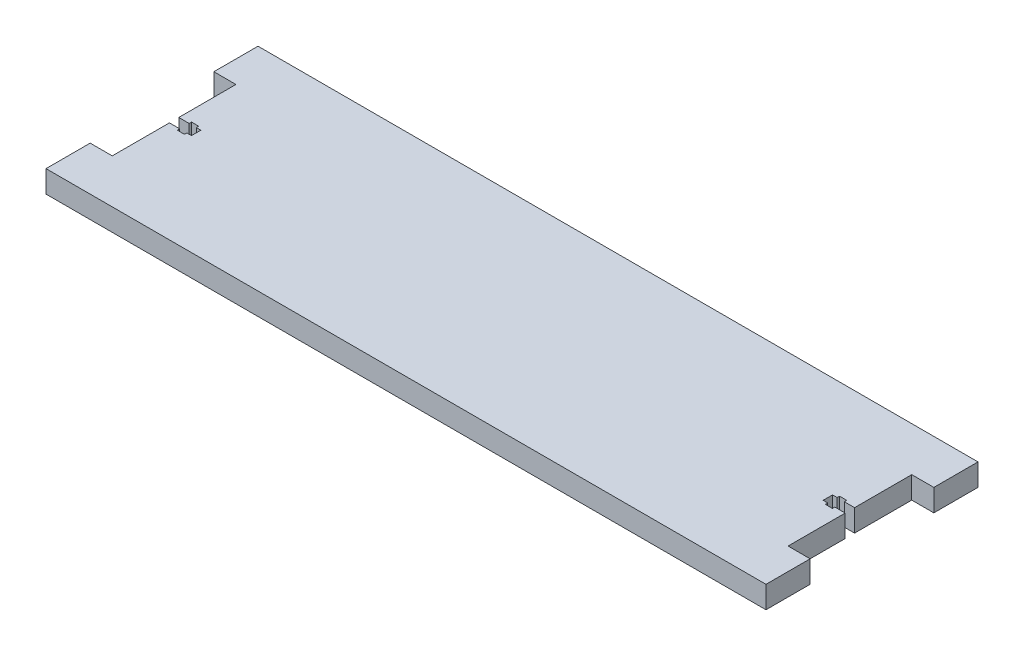
ISO-10303-21;
HEADER;
FILE_DESCRIPTION(('STEP AP214'),'2;1');
FILE_NAME('part.step','',(''),(''),'','','');
FILE_SCHEMA(('AUTOMOTIVE_DESIGN { 1 0 10303 214 1 1 1 1 }'));
ENDSEC;
DATA;
#1=APPLICATION_CONTEXT('core data for automotive mechanical design processes');
#2=APPLICATION_PROTOCOL_DEFINITION('international standard','automotive_design',2000,#1);
#3=PRODUCT_CONTEXT('',#1,'mechanical');
#4=PRODUCT('Part','Part','',(#3));
#5=PRODUCT_RELATED_PRODUCT_CATEGORY('part','',(#4));
#6=PRODUCT_DEFINITION_FORMATION('','',#4);
#7=PRODUCT_DEFINITION_CONTEXT('part definition',#1,'design');
#8=PRODUCT_DEFINITION('design','',#6,#7);
#9=PRODUCT_DEFINITION_SHAPE('','',#8);
#10=(LENGTH_UNIT() NAMED_UNIT(*) SI_UNIT(.MILLI.,.METRE.));
#11=(NAMED_UNIT(*) PLANE_ANGLE_UNIT() SI_UNIT($,.RADIAN.));
#12=(NAMED_UNIT(*) SI_UNIT($,.STERADIAN.) SOLID_ANGLE_UNIT());
#13=UNCERTAINTY_MEASURE_WITH_UNIT(LENGTH_MEASURE(1.E-05),#10,'distance_accuracy_value','');
#14=(GEOMETRIC_REPRESENTATION_CONTEXT(3) GLOBAL_UNCERTAINTY_ASSIGNED_CONTEXT((#13)) GLOBAL_UNIT_ASSIGNED_CONTEXT((#10,
#11,#12)) REPRESENTATION_CONTEXT('',''));
#15=CARTESIAN_POINT('',(0.,0.,0.));
#16=DIRECTION('',(0.,0.,1.));
#17=DIRECTION('',(1.,0.,0.));
#18=AXIS2_PLACEMENT_3D('',#15,#16,#17);
#19=CARTESIAN_POINT('',(0.,12.7,0.));
#20=DIRECTION('',(0.,-1.,0.));
#21=DIRECTION('',(0.,0.,-1.));
#22=AXIS2_PLACEMENT_3D('',#19,#20,#21);
#23=PLANE('',#22);
#24=DIRECTION('',(0.,0.,1.));
#25=VECTOR('',#24,1.);
#26=CARTESIAN_POINT('',(382.67,12.7,-56.885));
#27=LINE('',#26,#25);
#28=CARTESIAN_POINT('',(382.67,12.7,-58.26));
#29=VERTEX_POINT('',#28);
#30=CARTESIAN_POINT('',(382.67,12.7,-56.885));
#31=VERTEX_POINT('',#30);
#32=EDGE_CURVE('E302',#29,#31,#27,.T.);
#33=ORIENTED_EDGE('',*,*,#32,.T.);
#34=DIRECTION('',(-1.,0.,0.));
#35=VECTOR('',#34,1.);
#36=CARTESIAN_POINT('',(378.57,12.7,-56.885));
#37=LINE('',#36,#35);
#38=CARTESIAN_POINT('',(378.57,12.7,-56.885));
#39=VERTEX_POINT('',#38);
#40=EDGE_CURVE('E296',#31,#39,#37,.T.);
#41=ORIENTED_EDGE('',*,*,#40,.T.);
#42=DIRECTION('',(0.,0.,-1.));
#43=VECTOR('',#42,1.);
#44=CARTESIAN_POINT('',(378.57,12.7,-56.885));
#45=LINE('',#44,#43);
#46=CARTESIAN_POINT('',(378.57,12.7,-58.26));
#47=VERTEX_POINT('',#46);
#48=EDGE_CURVE('E282',#39,#47,#45,.T.);
#49=ORIENTED_EDGE('',*,*,#48,.T.);
#50=DIRECTION('',(1.,0.,0.));
#51=VECTOR('',#50,1.);
#52=CARTESIAN_POINT('',(375.92,12.7,-58.26));
#53=LINE('',#52,#51);
#54=CARTESIAN_POINT('',(375.92,12.7,-58.26));
#55=VERTEX_POINT('',#54);
#56=EDGE_CURVE('E326',#55,#47,#53,.T.);
#57=ORIENTED_EDGE('',*,*,#56,.F.);
#58=DIRECTION('',(0.,0.,-1.));
#59=VECTOR('',#58,1.);
#60=CARTESIAN_POINT('',(375.92,12.7,-63.66));
#61=LINE('',#60,#59);
#62=CARTESIAN_POINT('',(375.92,12.7,-63.66));
#63=VERTEX_POINT('',#62);
#64=EDGE_CURVE('E318',#55,#63,#61,.T.);
#65=ORIENTED_EDGE('',*,*,#64,.T.);
#66=DIRECTION('',(1.,0.,0.));
#67=VECTOR('',#66,1.);
#68=CARTESIAN_POINT('',(375.92,12.7,-63.66));
#69=LINE('',#68,#67);
#70=CARTESIAN_POINT('',(378.57,12.7,-63.66));
#71=VERTEX_POINT('',#70);
#72=EDGE_CURVE('E331',#63,#71,#69,.T.);
#73=ORIENTED_EDGE('',*,*,#72,.T.);
#74=CARTESIAN_POINT('',(378.57,12.7,-65.035));
#75=VERTEX_POINT('',#74);
#76=EDGE_CURVE('E56',#71,#75,#45,.T.);
#77=ORIENTED_EDGE('',*,*,#76,.T.);
#78=DIRECTION('',(1.,0.,0.));
#79=VECTOR('',#78,1.);
#80=CARTESIAN_POINT('',(378.57,12.7,-65.035));
#81=LINE('',#80,#79);
#82=CARTESIAN_POINT('',(382.67,12.7,-65.035));
#83=VERTEX_POINT('',#82);
#84=EDGE_CURVE('E281',#75,#83,#81,.T.);
#85=ORIENTED_EDGE('',*,*,#84,.T.);
#86=CARTESIAN_POINT('',(382.67,12.7,-63.66));
#87=VERTEX_POINT('',#86);
#88=EDGE_CURVE('E297',#83,#87,#27,.T.);
#89=ORIENTED_EDGE('',*,*,#88,.T.);
#90=CARTESIAN_POINT('',(388.62,12.7,-63.66));
#91=VERTEX_POINT('',#90);
#92=EDGE_CURVE('E334',#87,#91,#69,.T.);
#93=ORIENTED_EDGE('',*,*,#92,.T.);
#94=DIRECTION('',(0.,0.,-1.));
#95=VECTOR('',#94,1.);
#96=CARTESIAN_POINT('',(388.62,12.7,0.));
#97=LINE('',#96,#95);
#98=CARTESIAN_POINT('',(388.62,12.7,-96.5199999999999));
#99=VERTEX_POINT('',#98);
#100=EDGE_CURVE('E497',#91,#99,#97,.T.);
#101=ORIENTED_EDGE('',*,*,#100,.T.);
#102=DIRECTION('',(1.,0.,0.));
#103=VECTOR('',#102,1.);
#104=CARTESIAN_POINT('',(388.62,12.7,-96.5199999999999));
#105=LINE('',#104,#103);
#106=CARTESIAN_POINT('',(401.32,12.7,-96.5199999999999));
#107=VERTEX_POINT('',#106);
#108=EDGE_CURVE('E403',#99,#107,#105,.T.);
#109=ORIENTED_EDGE('',*,*,#108,.T.);
#110=DIRECTION('',(0.,0.,-1.));
#111=VECTOR('',#110,1.);
#112=CARTESIAN_POINT('',(401.32,12.7,-121.92));
#113=LINE('',#112,#111);
#114=CARTESIAN_POINT('',(401.32,12.7,-121.92));
#115=VERTEX_POINT('',#114);
#116=EDGE_CURVE('E416',#107,#115,#113,.T.);
#117=ORIENTED_EDGE('',*,*,#116,.T.);
#118=DIRECTION('',(-1.,0.,0.));
#119=VECTOR('',#118,1.);
#120=CARTESIAN_POINT('',(0.,12.7,-121.92));
#121=LINE('',#120,#119);
#122=CARTESIAN_POINT('',(-12.7,12.7,-121.92));
#123=VERTEX_POINT('',#122);
#124=EDGE_CURVE('E476',#115,#123,#121,.T.);
#125=ORIENTED_EDGE('',*,*,#124,.T.);
#126=DIRECTION('',(0.,0.,1.));
#127=VECTOR('',#126,1.);
#128=CARTESIAN_POINT('',(-12.7,12.7,-121.92));
#129=LINE('',#128,#127);
#130=CARTESIAN_POINT('',(-12.7,12.7,-96.5199999999999));
#131=VERTEX_POINT('',#130);
#132=EDGE_CURVE('E546',#123,#131,#129,.T.);
#133=ORIENTED_EDGE('',*,*,#132,.T.);
#134=DIRECTION('',(1.,0.,0.));
#135=VECTOR('',#134,1.);
#136=CARTESIAN_POINT('',(0.,12.7,-96.5199999999999));
#137=LINE('',#136,#135);
#138=CARTESIAN_POINT('',(0.,12.7,-96.5199999999999));
#139=VERTEX_POINT('',#138);
#140=EDGE_CURVE('E544',#131,#139,#137,.T.);
#141=ORIENTED_EDGE('',*,*,#140,.T.);
#142=DIRECTION('',(0.,0.,1.));
#143=VECTOR('',#142,1.);
#144=CARTESIAN_POINT('',(0.,12.7,0.));
#145=LINE('',#144,#143);
#146=CARTESIAN_POINT('',(0.,12.7,-63.66));
#147=VERTEX_POINT('',#146);
#148=EDGE_CURVE('E485',#139,#147,#145,.T.);
#149=ORIENTED_EDGE('',*,*,#148,.T.);
#150=DIRECTION('',(-1.,0.,0.));
#151=VECTOR('',#150,1.);
#152=CARTESIAN_POINT('',(12.7,12.7,-63.66));
#153=LINE('',#152,#151);
#154=CARTESIAN_POINT('',(5.95,12.7,-63.66));
#155=VERTEX_POINT('',#154);
#156=EDGE_CURVE('E412',#155,#147,#153,.T.);
#157=ORIENTED_EDGE('',*,*,#156,.F.);
#158=DIRECTION('',(0.,0.,1.));
#159=VECTOR('',#158,1.);
#160=CARTESIAN_POINT('',(5.95,12.7,-56.8849999999999));
#161=LINE('',#160,#159);
#162=CARTESIAN_POINT('',(5.95,12.7,-65.035));
#163=VERTEX_POINT('',#162);
#164=EDGE_CURVE('E351',#163,#155,#161,.T.);
#165=ORIENTED_EDGE('',*,*,#164,.F.);
#166=DIRECTION('',(-1.,0.,0.));
#167=VECTOR('',#166,1.);
#168=CARTESIAN_POINT('',(10.05,12.7,-65.035));
#169=LINE('',#168,#167);
#170=CARTESIAN_POINT('',(10.05,12.7,-65.035));
#171=VERTEX_POINT('',#170);
#172=EDGE_CURVE('E341',#171,#163,#169,.T.);
#173=ORIENTED_EDGE('',*,*,#172,.F.);
#174=DIRECTION('',(0.,0.,-1.));
#175=VECTOR('',#174,1.);
#176=CARTESIAN_POINT('',(10.05,12.7,-56.8849999999999));
#177=LINE('',#176,#175);
#178=CARTESIAN_POINT('',(10.05,12.7,-63.66));
#179=VERTEX_POINT('',#178);
#180=EDGE_CURVE('E347',#179,#171,#177,.T.);
#181=ORIENTED_EDGE('',*,*,#180,.F.);
#182=CARTESIAN_POINT('',(12.7,12.7,-63.66));
#183=VERTEX_POINT('',#182);
#184=EDGE_CURVE('E409',#183,#179,#153,.T.);
#185=ORIENTED_EDGE('',*,*,#184,.F.);
#186=DIRECTION('',(0.,0.,-1.));
#187=VECTOR('',#186,1.);
#188=CARTESIAN_POINT('',(12.7,12.7,-63.66));
#189=LINE('',#188,#187);
#190=CARTESIAN_POINT('',(12.7,12.7,-58.2599999999999));
#191=VERTEX_POINT('',#190);
#192=EDGE_CURVE('E386',#191,#183,#189,.T.);
#193=ORIENTED_EDGE('',*,*,#192,.F.);
#194=DIRECTION('',(-1.,0.,0.));
#195=VECTOR('',#194,1.);
#196=CARTESIAN_POINT('',(12.7,12.7,-58.2599999999999));
#197=LINE('',#196,#195);
#198=CARTESIAN_POINT('',(10.05,12.7,-58.2599999999999));
#199=VERTEX_POINT('',#198);
#200=EDGE_CURVE('E413',#191,#199,#197,.T.);
#201=ORIENTED_EDGE('',*,*,#200,.T.);
#202=CARTESIAN_POINT('',(10.05,12.7,-56.8849999999999));
#203=VERTEX_POINT('',#202);
#204=EDGE_CURVE('E345',#203,#199,#177,.T.);
#205=ORIENTED_EDGE('',*,*,#204,.F.);
#206=DIRECTION('',(1.,0.,0.));
#207=VECTOR('',#206,1.);
#208=CARTESIAN_POINT('',(10.05,12.7,-56.8849999999999));
#209=LINE('',#208,#207);
#210=CARTESIAN_POINT('',(5.95,12.7,-56.8849999999999));
#211=VERTEX_POINT('',#210);
#212=EDGE_CURVE('E348',#211,#203,#209,.T.);
#213=ORIENTED_EDGE('',*,*,#212,.F.);
#214=CARTESIAN_POINT('',(5.95,12.7,-58.2599999999999));
#215=VERTEX_POINT('',#214);
#216=EDGE_CURVE('E329',#215,#211,#161,.T.);
#217=ORIENTED_EDGE('',*,*,#216,.F.);
#218=CARTESIAN_POINT('',(0.,12.7,-58.2599999999999));
#219=VERTEX_POINT('',#218);
#220=EDGE_CURVE('E395',#215,#219,#197,.T.);
#221=ORIENTED_EDGE('',*,*,#220,.T.);
#222=CARTESIAN_POINT('',(0.,12.7,-25.4));
#223=VERTEX_POINT('',#222);
#224=EDGE_CURVE('E470',#219,#223,#145,.T.);
#225=ORIENTED_EDGE('',*,*,#224,.T.);
#226=DIRECTION('',(-1.,0.,0.));
#227=VECTOR('',#226,1.);
#228=CARTESIAN_POINT('',(0.,12.7,-25.4));
#229=LINE('',#228,#227);
#230=CARTESIAN_POINT('',(-12.7,12.7,-25.4));
#231=VERTEX_POINT('',#230);
#232=EDGE_CURVE('E452',#223,#231,#229,.T.);
#233=ORIENTED_EDGE('',*,*,#232,.T.);
#234=DIRECTION('',(0.,0.,1.));
#235=VECTOR('',#234,1.);
#236=CARTESIAN_POINT('',(-12.7,12.7,0.));
#237=LINE('',#236,#235);
#238=CARTESIAN_POINT('',(-12.7,12.7,0.));
#239=VERTEX_POINT('',#238);
#240=EDGE_CURVE('E621',#231,#239,#237,.T.);
#241=ORIENTED_EDGE('',*,*,#240,.T.);
#242=DIRECTION('',(1.,0.,0.));
#243=VECTOR('',#242,1.);
#244=CARTESIAN_POINT('',(0.,12.7,0.));
#245=LINE('',#244,#243);
#246=CARTESIAN_POINT('',(401.32,12.7,0.));
#247=VERTEX_POINT('',#246);
#248=EDGE_CURVE('E488',#239,#247,#245,.T.);
#249=ORIENTED_EDGE('',*,*,#248,.T.);
#250=DIRECTION('',(0.,0.,-1.));
#251=VECTOR('',#250,1.);
#252=CARTESIAN_POINT('',(401.32,12.7,0.));
#253=LINE('',#252,#251);
#254=CARTESIAN_POINT('',(401.32,12.7,-25.4));
#255=VERTEX_POINT('',#254);
#256=EDGE_CURVE('E432',#247,#255,#253,.T.);
#257=ORIENTED_EDGE('',*,*,#256,.T.);
#258=DIRECTION('',(-1.,0.,0.));
#259=VECTOR('',#258,1.);
#260=CARTESIAN_POINT('',(388.62,12.7,-25.4));
#261=LINE('',#260,#259);
#262=CARTESIAN_POINT('',(388.62,12.7,-25.4));
#263=VERTEX_POINT('',#262);
#264=EDGE_CURVE('E438',#255,#263,#261,.T.);
#265=ORIENTED_EDGE('',*,*,#264,.T.);
#266=CARTESIAN_POINT('',(388.62,12.7,-58.26));
#267=VERTEX_POINT('',#266);
#268=EDGE_CURVE('E454',#263,#267,#97,.T.);
#269=ORIENTED_EDGE('',*,*,#268,.T.);
#270=EDGE_CURVE('E330',#29,#267,#53,.T.);
#271=ORIENTED_EDGE('',*,*,#270,.F.);
#272=EDGE_LOOP('',(#33,#41,#49,#57,#65,#73,#77,#85,#89,#93,#101,#109,#117,#125,#133,#141,#149,
#157,#165,#173,#181,#185,#193,#201,#205,#213,#217,#221,#225,#233,#241,#249,#257,#265,#269,#271));
#273=FACE_BOUND('',#272,.T.);
#274=ADVANCED_FACE('F33',(#273),#23,.F.);
#275=CARTESIAN_POINT('',(0.,0.,0.));
#276=DIRECTION('',(0.,-1.,0.));
#277=DIRECTION('',(0.,0.,-1.));
#278=AXIS2_PLACEMENT_3D('',#275,#276,#277);
#279=PLANE('',#278);
#280=DIRECTION('',(-1.,0.,0.));
#281=VECTOR('',#280,1.);
#282=CARTESIAN_POINT('',(378.57,0.,-56.885));
#283=LINE('',#282,#281);
#284=CARTESIAN_POINT('',(382.67,0.,-56.885));
#285=VERTEX_POINT('',#284);
#286=CARTESIAN_POINT('',(378.57,0.,-56.885));
#287=VERTEX_POINT('',#286);
#288=EDGE_CURVE('E273',#285,#287,#283,.T.);
#289=ORIENTED_EDGE('',*,*,#288,.F.);
#290=DIRECTION('',(0.,0.,1.));
#291=VECTOR('',#290,1.);
#292=CARTESIAN_POINT('',(382.67,0.,-56.885));
#293=LINE('',#292,#291);
#294=CARTESIAN_POINT('',(382.67,0.,-58.26));
#295=VERTEX_POINT('',#294);
#296=EDGE_CURVE('E288',#295,#285,#293,.T.);
#297=ORIENTED_EDGE('',*,*,#296,.F.);
#298=DIRECTION('',(1.,0.,0.));
#299=VECTOR('',#298,1.);
#300=CARTESIAN_POINT('',(375.92,0.,-58.26));
#301=LINE('',#300,#299);
#302=CARTESIAN_POINT('',(388.62,0.,-58.26));
#303=VERTEX_POINT('',#302);
#304=EDGE_CURVE('E321',#295,#303,#301,.T.);
#305=ORIENTED_EDGE('',*,*,#304,.T.);
#306=DIRECTION('',(0.,0.,-1.));
#307=VECTOR('',#306,1.);
#308=CARTESIAN_POINT('',(388.62,0.,0.));
#309=LINE('',#308,#307);
#310=CARTESIAN_POINT('',(388.62,0.,-25.4));
#311=VERTEX_POINT('',#310);
#312=EDGE_CURVE('E531',#311,#303,#309,.T.);
#313=ORIENTED_EDGE('',*,*,#312,.F.);
#314=DIRECTION('',(-1.,0.,0.));
#315=VECTOR('',#314,1.);
#316=CARTESIAN_POINT('',(388.62,0.,-25.4));
#317=LINE('',#316,#315);
#318=CARTESIAN_POINT('',(401.32,0.,-25.4));
#319=VERTEX_POINT('',#318);
#320=EDGE_CURVE('E453',#319,#311,#317,.T.);
#321=ORIENTED_EDGE('',*,*,#320,.F.);
#322=DIRECTION('',(0.,0.,-1.));
#323=VECTOR('',#322,1.);
#324=CARTESIAN_POINT('',(401.32,0.,0.));
#325=LINE('',#324,#323);
#326=CARTESIAN_POINT('',(401.32,0.,0.));
#327=VERTEX_POINT('',#326);
#328=EDGE_CURVE('E439',#327,#319,#325,.T.);
#329=ORIENTED_EDGE('',*,*,#328,.F.);
#330=DIRECTION('',(1.,0.,0.));
#331=VECTOR('',#330,1.);
#332=CARTESIAN_POINT('',(0.,0.,0.));
#333=LINE('',#332,#331);
#334=CARTESIAN_POINT('',(-12.7,0.,0.));
#335=VERTEX_POINT('',#334);
#336=EDGE_CURVE('E477',#335,#327,#333,.T.);
#337=ORIENTED_EDGE('',*,*,#336,.F.);
#338=DIRECTION('',(0.,0.,1.));
#339=VECTOR('',#338,1.);
#340=CARTESIAN_POINT('',(-12.7,0.,0.));
#341=LINE('',#340,#339);
#342=CARTESIAN_POINT('',(-12.7,0.,-25.4));
#343=VERTEX_POINT('',#342);
#344=EDGE_CURVE('E553',#343,#335,#341,.T.);
#345=ORIENTED_EDGE('',*,*,#344,.F.);
#346=DIRECTION('',(-1.,0.,0.));
#347=VECTOR('',#346,1.);
#348=CARTESIAN_POINT('',(0.,0.,-25.4));
#349=LINE('',#348,#347);
#350=CARTESIAN_POINT('',(0.,0.,-25.4));
#351=VERTEX_POINT('',#350);
#352=EDGE_CURVE('E632',#351,#343,#349,.T.);
#353=ORIENTED_EDGE('',*,*,#352,.F.);
#354=DIRECTION('',(0.,0.,1.));
#355=VECTOR('',#354,1.);
#356=CARTESIAN_POINT('',(0.,0.,0.));
#357=LINE('',#356,#355);
#358=CARTESIAN_POINT('',(0.,0.,-58.2599999999999));
#359=VERTEX_POINT('',#358);
#360=EDGE_CURVE('E465',#359,#351,#357,.T.);
#361=ORIENTED_EDGE('',*,*,#360,.F.);
#362=DIRECTION('',(-1.,0.,0.));
#363=VECTOR('',#362,1.);
#364=CARTESIAN_POINT('',(12.7,0.,-58.2599999999999));
#365=LINE('',#364,#363);
#366=CARTESIAN_POINT('',(5.95,0.,-58.2599999999999));
#367=VERTEX_POINT('',#366);
#368=EDGE_CURVE('E404',#367,#359,#365,.T.);
#369=ORIENTED_EDGE('',*,*,#368,.F.);
#370=DIRECTION('',(0.,0.,1.));
#371=VECTOR('',#370,1.);
#372=CARTESIAN_POINT('',(5.95,0.,-56.8849999999999));
#373=LINE('',#372,#371);
#374=CARTESIAN_POINT('',(5.95,0.,-56.8849999999999));
#375=VERTEX_POINT('',#374);
#376=EDGE_CURVE('E360',#367,#375,#373,.T.);
#377=ORIENTED_EDGE('',*,*,#376,.T.);
#378=DIRECTION('',(1.,0.,0.));
#379=VECTOR('',#378,1.);
#380=CARTESIAN_POINT('',(10.05,0.,-56.8849999999999));
#381=LINE('',#380,#379);
#382=CARTESIAN_POINT('',(10.05,0.,-56.8849999999999));
#383=VERTEX_POINT('',#382);
#384=EDGE_CURVE('E344',#375,#383,#381,.T.);
#385=ORIENTED_EDGE('',*,*,#384,.T.);
#386=DIRECTION('',(0.,0.,-1.));
#387=VECTOR('',#386,1.);
#388=CARTESIAN_POINT('',(10.05,0.,-56.8849999999999));
#389=LINE('',#388,#387);
#390=CARTESIAN_POINT('',(10.05,0.,-58.2599999999999));
#391=VERTEX_POINT('',#390);
#392=EDGE_CURVE('E366',#383,#391,#389,.T.);
#393=ORIENTED_EDGE('',*,*,#392,.T.);
#394=CARTESIAN_POINT('',(12.7,0.,-58.2599999999999));
#395=VERTEX_POINT('',#394);
#396=EDGE_CURVE('E400',#395,#391,#365,.T.);
#397=ORIENTED_EDGE('',*,*,#396,.F.);
#398=DIRECTION('',(0.,0.,1.));
#399=VECTOR('',#398,1.);
#400=CARTESIAN_POINT('',(12.7,0.,-63.66));
#401=LINE('',#400,#399);
#402=CARTESIAN_POINT('',(12.7,0.,-63.66));
#403=VERTEX_POINT('',#402);
#404=EDGE_CURVE('E392',#403,#395,#401,.T.);
#405=ORIENTED_EDGE('',*,*,#404,.F.);
#406=DIRECTION('',(-1.,0.,0.));
#407=VECTOR('',#406,1.);
#408=CARTESIAN_POINT('',(12.7,0.,-63.66));
#409=LINE('',#408,#407);
#410=CARTESIAN_POINT('',(10.05,0.,-63.66));
#411=VERTEX_POINT('',#410);
#412=EDGE_CURVE('E405',#403,#411,#409,.T.);
#413=ORIENTED_EDGE('',*,*,#412,.T.);
#414=CARTESIAN_POINT('',(10.05,0.,-65.035));
#415=VERTEX_POINT('',#414);
#416=EDGE_CURVE('E369',#411,#415,#389,.T.);
#417=ORIENTED_EDGE('',*,*,#416,.T.);
#418=DIRECTION('',(-1.,0.,0.));
#419=VECTOR('',#418,1.);
#420=CARTESIAN_POINT('',(10.05,0.,-65.035));
#421=LINE('',#420,#419);
#422=CARTESIAN_POINT('',(5.95,0.,-65.035));
#423=VERTEX_POINT('',#422);
#424=EDGE_CURVE('E361',#415,#423,#421,.T.);
#425=ORIENTED_EDGE('',*,*,#424,.T.);
#426=CARTESIAN_POINT('',(5.95,0.,-63.66));
#427=VERTEX_POINT('',#426);
#428=EDGE_CURVE('E356',#423,#427,#373,.T.);
#429=ORIENTED_EDGE('',*,*,#428,.T.);
#430=CARTESIAN_POINT('',(0.,0.,-63.66));
#431=VERTEX_POINT('',#430);
#432=EDGE_CURVE('E408',#427,#431,#409,.T.);
#433=ORIENTED_EDGE('',*,*,#432,.T.);
#434=CARTESIAN_POINT('',(0.,0.,-96.5199999999999));
#435=VERTEX_POINT('',#434);
#436=EDGE_CURVE('E468',#435,#431,#357,.T.);
#437=ORIENTED_EDGE('',*,*,#436,.F.);
#438=DIRECTION('',(1.,0.,0.));
#439=VECTOR('',#438,1.);
#440=CARTESIAN_POINT('',(0.,0.,-96.5199999999999));
#441=LINE('',#440,#439);
#442=CARTESIAN_POINT('',(-12.7,0.,-96.5199999999999));
#443=VERTEX_POINT('',#442);
#444=EDGE_CURVE('E539',#443,#435,#441,.T.);
#445=ORIENTED_EDGE('',*,*,#444,.F.);
#446=DIRECTION('',(0.,0.,1.));
#447=VECTOR('',#446,1.);
#448=CARTESIAN_POINT('',(-12.7,0.,-121.92));
#449=LINE('',#448,#447);
#450=CARTESIAN_POINT('',(-12.7,0.,-121.92));
#451=VERTEX_POINT('',#450);
#452=EDGE_CURVE('E548',#451,#443,#449,.T.);
#453=ORIENTED_EDGE('',*,*,#452,.F.);
#454=DIRECTION('',(-1.,0.,0.));
#455=VECTOR('',#454,1.);
#456=CARTESIAN_POINT('',(0.,0.,-121.92));
#457=LINE('',#456,#455);
#458=CARTESIAN_POINT('',(401.32,0.,-121.92));
#459=VERTEX_POINT('',#458);
#460=EDGE_CURVE('E484',#459,#451,#457,.T.);
#461=ORIENTED_EDGE('',*,*,#460,.F.);
#462=DIRECTION('',(0.,0.,-1.));
#463=VECTOR('',#462,1.);
#464=CARTESIAN_POINT('',(401.32,0.,-121.92));
#465=LINE('',#464,#463);
#466=CARTESIAN_POINT('',(401.32,0.,-96.5199999999999));
#467=VERTEX_POINT('',#466);
#468=EDGE_CURVE('E422',#467,#459,#465,.T.);
#469=ORIENTED_EDGE('',*,*,#468,.F.);
#470=DIRECTION('',(1.,0.,0.));
#471=VECTOR('',#470,1.);
#472=CARTESIAN_POINT('',(388.62,0.,-96.5199999999999));
#473=LINE('',#472,#471);
#474=CARTESIAN_POINT('',(388.62,0.,-96.5199999999999));
#475=VERTEX_POINT('',#474);
#476=EDGE_CURVE('E427',#475,#467,#473,.T.);
#477=ORIENTED_EDGE('',*,*,#476,.F.);
#478=CARTESIAN_POINT('',(388.62,0.,-63.66));
#479=VERTEX_POINT('',#478);
#480=EDGE_CURVE('E502',#479,#475,#309,.T.);
#481=ORIENTED_EDGE('',*,*,#480,.F.);
#482=DIRECTION('',(1.,0.,0.));
#483=VECTOR('',#482,1.);
#484=CARTESIAN_POINT('',(375.92,0.,-63.66));
#485=LINE('',#484,#483);
#486=CARTESIAN_POINT('',(382.67,0.,-63.66));
#487=VERTEX_POINT('',#486);
#488=EDGE_CURVE('E337',#487,#479,#485,.T.);
#489=ORIENTED_EDGE('',*,*,#488,.F.);
#490=CARTESIAN_POINT('',(382.67,0.,-65.035));
#491=VERTEX_POINT('',#490);
#492=EDGE_CURVE('E287',#491,#487,#293,.T.);
#493=ORIENTED_EDGE('',*,*,#492,.F.);
#494=DIRECTION('',(1.,0.,0.));
#495=VECTOR('',#494,1.);
#496=CARTESIAN_POINT('',(378.57,0.,-65.035));
#497=LINE('',#496,#495);
#498=CARTESIAN_POINT('',(378.57,0.,-65.035));
#499=VERTEX_POINT('',#498);
#500=EDGE_CURVE('E278',#499,#491,#497,.T.);
#501=ORIENTED_EDGE('',*,*,#500,.F.);
#502=DIRECTION('',(0.,0.,-1.));
#503=VECTOR('',#502,1.);
#504=CARTESIAN_POINT('',(378.57,0.,-56.885));
#505=LINE('',#504,#503);
#506=CARTESIAN_POINT('',(378.57,0.,-63.66));
#507=VERTEX_POINT('',#506);
#508=EDGE_CURVE('E264',#507,#499,#505,.T.);
#509=ORIENTED_EDGE('',*,*,#508,.F.);
#510=CARTESIAN_POINT('',(375.92,0.,-63.66));
#511=VERTEX_POINT('',#510);
#512=EDGE_CURVE('E335',#511,#507,#485,.T.);
#513=ORIENTED_EDGE('',*,*,#512,.F.);
#514=DIRECTION('',(0.,0.,1.));
#515=VECTOR('',#514,1.);
#516=CARTESIAN_POINT('',(375.92,0.,-63.66));
#517=LINE('',#516,#515);
#518=CARTESIAN_POINT('',(375.92,0.,-58.26));
#519=VERTEX_POINT('',#518);
#520=EDGE_CURVE('E312',#511,#519,#517,.T.);
#521=ORIENTED_EDGE('',*,*,#520,.T.);
#522=CARTESIAN_POINT('',(378.57,0.,-58.26));
#523=VERTEX_POINT('',#522);
#524=EDGE_CURVE('E338',#519,#523,#301,.T.);
#525=ORIENTED_EDGE('',*,*,#524,.T.);
#526=EDGE_CURVE('E48',#287,#523,#505,.T.);
#527=ORIENTED_EDGE('',*,*,#526,.F.);
#528=EDGE_LOOP('',(#289,#297,#305,#313,#321,#329,#337,#345,#353,#361,#369,#377,#385,#393,#397,
#405,#413,#417,#425,#429,#433,#437,#445,#453,#461,#469,#477,#481,#489,#493,#501,#509,#513,#521,
#525,#527));
#529=FACE_BOUND('',#528,.T.);
#530=ADVANCED_FACE('F285',(#529),#279,.T.);
#531=CARTESIAN_POINT('',(375.92,0.,-58.26));
#532=DIRECTION('',(0.,0.,-1.));
#533=DIRECTION('',(-1.,0.,0.));
#534=AXIS2_PLACEMENT_3D('',#531,#532,#533);
#535=PLANE('',#534);
#536=ORIENTED_EDGE('',*,*,#304,.F.);
#537=DIRECTION('',(0.,1.,0.));
#538=VECTOR('',#537,1.);
#539=CARTESIAN_POINT('',(382.67,0.,-58.26));
#540=LINE('',#539,#538);
#541=EDGE_CURVE('E305',#295,#29,#540,.T.);
#542=ORIENTED_EDGE('',*,*,#541,.T.);
#543=ORIENTED_EDGE('',*,*,#270,.T.);
#544=DIRECTION('',(0.,1.,0.));
#545=VECTOR('',#544,1.);
#546=CARTESIAN_POINT('',(388.62,0.,-58.26));
#547=LINE('',#546,#545);
#548=EDGE_CURVE('E308',#303,#267,#547,.T.);
#549=ORIENTED_EDGE('',*,*,#548,.F.);
#550=EDGE_LOOP('',(#536,#542,#543,#549));
#551=FACE_BOUND('',#550,.T.);
#552=ADVANCED_FACE('F657',(#551),#535,.T.);
#553=ORIENTED_EDGE('',*,*,#56,.T.);
#554=DIRECTION('',(0.,-1.,0.));
#555=VECTOR('',#554,1.);
#556=CARTESIAN_POINT('',(378.57,0.,-58.26));
#557=LINE('',#556,#555);
#558=EDGE_CURVE('E303',#47,#523,#557,.T.);
#559=ORIENTED_EDGE('',*,*,#558,.T.);
#560=ORIENTED_EDGE('',*,*,#524,.F.);
#561=DIRECTION('',(0.,1.,0.));
#562=VECTOR('',#561,1.);
#563=CARTESIAN_POINT('',(375.92,0.,-58.26));
#564=LINE('',#563,#562);
#565=EDGE_CURVE('E309',#519,#55,#564,.T.);
#566=ORIENTED_EDGE('',*,*,#565,.T.);
#567=EDGE_LOOP('',(#553,#559,#560,#566));
#568=FACE_BOUND('',#567,.T.);
#569=ADVANCED_FACE('F733',(#568),#535,.T.);
#570=CARTESIAN_POINT('',(375.92,0.,-63.66));
#571=DIRECTION('',(0.,0.,1.));
#572=DIRECTION('',(1.,0.,0.));
#573=AXIS2_PLACEMENT_3D('',#570,#571,#572);
#574=PLANE('',#573);
#575=ORIENTED_EDGE('',*,*,#92,.F.);
#576=DIRECTION('',(0.,-1.,0.));
#577=VECTOR('',#576,1.);
#578=CARTESIAN_POINT('',(382.67,0.,-63.66));
#579=LINE('',#578,#577);
#580=EDGE_CURVE('E11',#87,#487,#579,.T.);
#581=ORIENTED_EDGE('',*,*,#580,.T.);
#582=ORIENTED_EDGE('',*,*,#488,.T.);
#583=DIRECTION('',(0.,-1.,0.));
#584=VECTOR('',#583,1.);
#585=CARTESIAN_POINT('',(388.62,0.,-63.66));
#586=LINE('',#585,#584);
#587=EDGE_CURVE('E313',#91,#479,#586,.T.);
#588=ORIENTED_EDGE('',*,*,#587,.F.);
#589=EDGE_LOOP('',(#575,#581,#582,#588));
#590=FACE_BOUND('',#589,.T.);
#591=ADVANCED_FACE('F715',(#590),#574,.T.);
#592=ORIENTED_EDGE('',*,*,#512,.T.);
#593=DIRECTION('',(0.,1.,0.));
#594=VECTOR('',#593,1.);
#595=CARTESIAN_POINT('',(378.57,0.,-63.66));
#596=LINE('',#595,#594);
#597=EDGE_CURVE('E41',#507,#71,#596,.T.);
#598=ORIENTED_EDGE('',*,*,#597,.T.);
#599=ORIENTED_EDGE('',*,*,#72,.F.);
#600=DIRECTION('',(0.,-1.,0.));
#601=VECTOR('',#600,1.);
#602=CARTESIAN_POINT('',(375.92,0.,-63.66));
#603=LINE('',#602,#601);
#604=EDGE_CURVE('E316',#63,#511,#603,.T.);
#605=ORIENTED_EDGE('',*,*,#604,.T.);
#606=EDGE_LOOP('',(#592,#598,#599,#605));
#607=FACE_BOUND('',#606,.T.);
#608=ADVANCED_FACE('F668',(#607),#574,.T.);
#609=CARTESIAN_POINT('',(388.62,12.7,0.));
#610=DIRECTION('',(-1.,0.,0.));
#611=DIRECTION('',(0.,0.,1.));
#612=AXIS2_PLACEMENT_3D('',#609,#610,#611);
#613=PLANE('',#612);
#614=ORIENTED_EDGE('',*,*,#548,.T.);
#615=ORIENTED_EDGE('',*,*,#268,.F.);
#616=DIRECTION('',(0.,1.,0.));
#617=VECTOR('',#616,1.);
#618=CARTESIAN_POINT('',(388.62,-28.3980633142474,-25.4));
#619=LINE('',#618,#617);
#620=EDGE_CURVE('E448',#311,#263,#619,.T.);
#621=ORIENTED_EDGE('',*,*,#620,.F.);
#622=ORIENTED_EDGE('',*,*,#312,.T.);
#623=EDGE_LOOP('',(#614,#615,#621,#622));
#624=FACE_BOUND('',#623,.T.);
#625=ADVANCED_FACE('F522',(#624),#613,.F.);
#626=ORIENTED_EDGE('',*,*,#587,.T.);
#627=ORIENTED_EDGE('',*,*,#480,.T.);
#628=DIRECTION('',(0.,1.,0.));
#629=VECTOR('',#628,1.);
#630=CARTESIAN_POINT('',(388.62,-28.3980633142474,-96.5199999999999));
#631=LINE('',#630,#629);
#632=EDGE_CURVE('E419',#475,#99,#631,.T.);
#633=ORIENTED_EDGE('',*,*,#632,.T.);
#634=ORIENTED_EDGE('',*,*,#100,.F.);
#635=EDGE_LOOP('',(#626,#627,#633,#634));
#636=FACE_BOUND('',#635,.T.);
#637=ADVANCED_FACE('F667',(#636),#613,.F.);
#638=CARTESIAN_POINT('',(12.7,0.,-58.2599999999999));
#639=DIRECTION('',(0.,0.,1.));
#640=DIRECTION('',(1.,0.,0.));
#641=AXIS2_PLACEMENT_3D('',#638,#639,#640);
#642=PLANE('',#641);
#643=ORIENTED_EDGE('',*,*,#396,.T.);
#644=DIRECTION('',(0.,1.,0.));
#645=VECTOR('',#644,1.);
#646=CARTESIAN_POINT('',(10.05,0.,-58.2599999999999));
#647=LINE('',#646,#645);
#648=EDGE_CURVE('E379',#391,#199,#647,.T.);
#649=ORIENTED_EDGE('',*,*,#648,.T.);
#650=ORIENTED_EDGE('',*,*,#200,.F.);
#651=DIRECTION('',(0.,1.,0.));
#652=VECTOR('',#651,1.);
#653=CARTESIAN_POINT('',(12.7,0.,-58.2599999999999));
#654=LINE('',#653,#652);
#655=EDGE_CURVE('E383',#395,#191,#654,.T.);
#656=ORIENTED_EDGE('',*,*,#655,.F.);
#657=EDGE_LOOP('',(#643,#649,#650,#656));
#658=FACE_BOUND('',#657,.T.);
#659=ADVANCED_FACE('F595',(#658),#642,.F.);
#660=CARTESIAN_POINT('',(12.7,0.,-63.66));
#661=DIRECTION('',(0.,0.,-1.));
#662=DIRECTION('',(-1.,0.,0.));
#663=AXIS2_PLACEMENT_3D('',#660,#661,#662);
#664=PLANE('',#663);
#665=ORIENTED_EDGE('',*,*,#184,.T.);
#666=DIRECTION('',(0.,-1.,0.));
#667=VECTOR('',#666,1.);
#668=CARTESIAN_POINT('',(10.05,0.,-63.66));
#669=LINE('',#668,#667);
#670=EDGE_CURVE('E504',#179,#411,#669,.T.);
#671=ORIENTED_EDGE('',*,*,#670,.T.);
#672=ORIENTED_EDGE('',*,*,#412,.F.);
#673=DIRECTION('',(0.,-1.,0.));
#674=VECTOR('',#673,1.);
#675=CARTESIAN_POINT('',(12.7,0.,-63.66));
#676=LINE('',#675,#674);
#677=EDGE_CURVE('E390',#183,#403,#676,.T.);
#678=ORIENTED_EDGE('',*,*,#677,.F.);
#679=EDGE_LOOP('',(#665,#671,#672,#678));
#680=FACE_BOUND('',#679,.T.);
#681=ADVANCED_FACE('F587',(#680),#664,.F.);
#682=CARTESIAN_POINT('',(0.,12.7,0.));
#683=DIRECTION('',(1.,0.,0.));
#684=DIRECTION('',(0.,0.,-1.));
#685=AXIS2_PLACEMENT_3D('',#682,#683,#684);
#686=PLANE('',#685);
#687=ORIENTED_EDGE('',*,*,#224,.F.);
#688=DIRECTION('',(0.,1.,0.));
#689=VECTOR('',#688,1.);
#690=CARTESIAN_POINT('',(0.,0.,-58.2599999999999));
#691=LINE('',#690,#689);
#692=EDGE_CURVE('E382',#359,#219,#691,.T.);
#693=ORIENTED_EDGE('',*,*,#692,.F.);
#694=ORIENTED_EDGE('',*,*,#360,.T.);
#695=DIRECTION('',(0.,1.,0.));
#696=VECTOR('',#695,1.);
#697=CARTESIAN_POINT('',(0.,-28.3980633142474,-25.4));
#698=LINE('',#697,#696);
#699=EDGE_CURVE('E557',#351,#223,#698,.T.);
#700=ORIENTED_EDGE('',*,*,#699,.T.);
#701=EDGE_LOOP('',(#687,#693,#694,#700));
#702=FACE_BOUND('',#701,.T.);
#703=ADVANCED_FACE('F615',(#702),#686,.F.);
#704=ORIENTED_EDGE('',*,*,#436,.T.);
#705=DIRECTION('',(0.,-1.,0.));
#706=VECTOR('',#705,1.);
#707=CARTESIAN_POINT('',(0.,0.,-63.66));
#708=LINE('',#707,#706);
#709=EDGE_CURVE('E387',#147,#431,#708,.T.);
#710=ORIENTED_EDGE('',*,*,#709,.F.);
#711=ORIENTED_EDGE('',*,*,#148,.F.);
#712=DIRECTION('',(0.,1.,0.));
#713=VECTOR('',#712,1.);
#714=CARTESIAN_POINT('',(0.,-28.3980633142474,-96.5199999999999));
#715=LINE('',#714,#713);
#716=EDGE_CURVE('E469',#435,#139,#715,.T.);
#717=ORIENTED_EDGE('',*,*,#716,.F.);
#718=EDGE_LOOP('',(#704,#710,#711,#717));
#719=FACE_BOUND('',#718,.T.);
#720=ADVANCED_FACE('F35',(#719),#686,.F.);
#721=CARTESIAN_POINT('',(0.,12.7,0.));
#722=DIRECTION('',(0.,0.,-1.));
#723=DIRECTION('',(-1.,0.,0.));
#724=AXIS2_PLACEMENT_3D('',#721,#722,#723);
#725=PLANE('',#724);
#726=ORIENTED_EDGE('',*,*,#336,.T.);
#727=DIRECTION('',(0.,1.,0.));
#728=VECTOR('',#727,1.);
#729=CARTESIAN_POINT('',(401.32,-28.3980633142474,0.));
#730=LINE('',#729,#728);
#731=EDGE_CURVE('E443',#327,#247,#730,.T.);
#732=ORIENTED_EDGE('',*,*,#731,.T.);
#733=ORIENTED_EDGE('',*,*,#248,.F.);
#734=DIRECTION('',(0.,1.,0.));
#735=VECTOR('',#734,1.);
#736=CARTESIAN_POINT('',(-12.7,-28.3980633142474,0.));
#737=LINE('',#736,#735);
#738=EDGE_CURVE('E549',#335,#239,#737,.T.);
#739=ORIENTED_EDGE('',*,*,#738,.F.);
#740=EDGE_LOOP('',(#726,#732,#733,#739));
#741=FACE_BOUND('',#740,.T.);
#742=ADVANCED_FACE('F639',(#741),#725,.F.);
#743=CARTESIAN_POINT('',(0.,12.7,-121.92));
#744=DIRECTION('',(0.,0.,1.));
#745=DIRECTION('',(1.,0.,0.));
#746=AXIS2_PLACEMENT_3D('',#743,#744,#745);
#747=PLANE('',#746);
#748=ORIENTED_EDGE('',*,*,#460,.T.);
#749=DIRECTION('',(0.,1.,0.));
#750=VECTOR('',#749,1.);
#751=CARTESIAN_POINT('',(-12.7,-28.3980633142474,-121.92));
#752=LINE('',#751,#750);
#753=EDGE_CURVE('E494',#451,#123,#752,.T.);
#754=ORIENTED_EDGE('',*,*,#753,.T.);
#755=ORIENTED_EDGE('',*,*,#124,.F.);
#756=DIRECTION('',(0.,1.,0.));
#757=VECTOR('',#756,1.);
#758=CARTESIAN_POINT('',(401.32,-28.3980633142474,-121.92));
#759=LINE('',#758,#757);
#760=EDGE_CURVE('E425',#459,#115,#759,.T.);
#761=ORIENTED_EDGE('',*,*,#760,.F.);
#762=EDGE_LOOP('',(#748,#754,#755,#761));
#763=FACE_BOUND('',#762,.T.);
#764=ADVANCED_FACE('F662',(#763),#747,.F.);
#765=CARTESIAN_POINT('',(-12.7,-28.3980633142474,-121.92));
#766=DIRECTION('',(-1.,0.,0.));
#767=DIRECTION('',(0.,0.,1.));
#768=AXIS2_PLACEMENT_3D('',#765,#766,#767);
#769=PLANE('',#768);
#770=ORIENTED_EDGE('',*,*,#753,.F.);
#771=ORIENTED_EDGE('',*,*,#452,.T.);
#772=DIRECTION('',(0.,1.,0.));
#773=VECTOR('',#772,1.);
#774=CARTESIAN_POINT('',(-12.7,-28.3980633142474,-96.5199999999999));
#775=LINE('',#774,#773);
#776=EDGE_CURVE('E542',#443,#131,#775,.T.);
#777=ORIENTED_EDGE('',*,*,#776,.T.);
#778=ORIENTED_EDGE('',*,*,#132,.F.);
#779=EDGE_LOOP('',(#770,#771,#777,#778));
#780=FACE_BOUND('',#779,.T.);
#781=ADVANCED_FACE('F564',(#780),#769,.T.);
#782=CARTESIAN_POINT('',(0.,-28.3980633142474,-96.5199999999999));
#783=DIRECTION('',(0.,0.,1.));
#784=DIRECTION('',(1.,0.,0.));
#785=AXIS2_PLACEMENT_3D('',#782,#783,#784);
#786=PLANE('',#785);
#787=ORIENTED_EDGE('',*,*,#776,.F.);
#788=ORIENTED_EDGE('',*,*,#444,.T.);
#789=ORIENTED_EDGE('',*,*,#716,.T.);
#790=ORIENTED_EDGE('',*,*,#140,.F.);
#791=EDGE_LOOP('',(#787,#788,#789,#790));
#792=FACE_BOUND('',#791,.T.);
#793=ADVANCED_FACE('F567',(#792),#786,.T.);
#794=CARTESIAN_POINT('',(0.,-28.3980633142474,-25.4));
#795=DIRECTION('',(0.,0.,-1.));
#796=DIRECTION('',(-1.,0.,0.));
#797=AXIS2_PLACEMENT_3D('',#794,#795,#796);
#798=PLANE('',#797);
#799=ORIENTED_EDGE('',*,*,#699,.F.);
#800=ORIENTED_EDGE('',*,*,#352,.T.);
#801=DIRECTION('',(0.,1.,0.));
#802=VECTOR('',#801,1.);
#803=CARTESIAN_POINT('',(-12.7,-28.3980633142474,-25.4));
#804=LINE('',#803,#802);
#805=EDGE_CURVE('E628',#343,#231,#804,.T.);
#806=ORIENTED_EDGE('',*,*,#805,.T.);
#807=ORIENTED_EDGE('',*,*,#232,.F.);
#808=EDGE_LOOP('',(#799,#800,#806,#807));
#809=FACE_BOUND('',#808,.T.);
#810=ADVANCED_FACE('F635',(#809),#798,.T.);
#811=CARTESIAN_POINT('',(-12.7,-28.3980633142474,0.));
#812=DIRECTION('',(-1.,0.,0.));
#813=DIRECTION('',(0.,0.,1.));
#814=AXIS2_PLACEMENT_3D('',#811,#812,#813);
#815=PLANE('',#814);
#816=ORIENTED_EDGE('',*,*,#805,.F.);
#817=ORIENTED_EDGE('',*,*,#344,.T.);
#818=ORIENTED_EDGE('',*,*,#738,.T.);
#819=ORIENTED_EDGE('',*,*,#240,.F.);
#820=EDGE_LOOP('',(#816,#817,#818,#819));
#821=FACE_BOUND('',#820,.T.);
#822=ADVANCED_FACE('F626',(#821),#815,.T.);
#823=CARTESIAN_POINT('',(401.32,-28.3980633142474,0.));
#824=DIRECTION('',(1.,0.,0.));
#825=DIRECTION('',(0.,0.,-1.));
#826=AXIS2_PLACEMENT_3D('',#823,#824,#825);
#827=PLANE('',#826);
#828=ORIENTED_EDGE('',*,*,#731,.F.);
#829=ORIENTED_EDGE('',*,*,#328,.T.);
#830=DIRECTION('',(0.,1.,0.));
#831=VECTOR('',#830,1.);
#832=CARTESIAN_POINT('',(401.32,-28.3980633142474,-25.4));
#833=LINE('',#832,#831);
#834=EDGE_CURVE('E442',#319,#255,#833,.T.);
#835=ORIENTED_EDGE('',*,*,#834,.T.);
#836=ORIENTED_EDGE('',*,*,#256,.F.);
#837=EDGE_LOOP('',(#828,#829,#835,#836));
#838=FACE_BOUND('',#837,.T.);
#839=ADVANCED_FACE('F642',(#838),#827,.T.);
#840=CARTESIAN_POINT('',(388.62,-28.3980633142474,-25.4));
#841=DIRECTION('',(0.,0.,-1.));
#842=DIRECTION('',(-1.,0.,0.));
#843=AXIS2_PLACEMENT_3D('',#840,#841,#842);
#844=PLANE('',#843);
#845=ORIENTED_EDGE('',*,*,#834,.F.);
#846=ORIENTED_EDGE('',*,*,#320,.T.);
#847=ORIENTED_EDGE('',*,*,#620,.T.);
#848=ORIENTED_EDGE('',*,*,#264,.F.);
#849=EDGE_LOOP('',(#845,#846,#847,#848));
#850=FACE_BOUND('',#849,.T.);
#851=ADVANCED_FACE('F528',(#850),#844,.T.);
#852=CARTESIAN_POINT('',(388.62,-28.3980633142474,-96.5199999999999));
#853=DIRECTION('',(0.,0.,1.));
#854=DIRECTION('',(1.,0.,0.));
#855=AXIS2_PLACEMENT_3D('',#852,#853,#854);
#856=PLANE('',#855);
#857=ORIENTED_EDGE('',*,*,#632,.F.);
#858=ORIENTED_EDGE('',*,*,#476,.T.);
#859=DIRECTION('',(0.,1.,0.));
#860=VECTOR('',#859,1.);
#861=CARTESIAN_POINT('',(401.32,-28.3980633142474,-96.5199999999999));
#862=LINE('',#861,#860);
#863=EDGE_CURVE('E426',#467,#107,#862,.T.);
#864=ORIENTED_EDGE('',*,*,#863,.T.);
#865=ORIENTED_EDGE('',*,*,#108,.F.);
#866=EDGE_LOOP('',(#857,#858,#864,#865));
#867=FACE_BOUND('',#866,.T.);
#868=ADVANCED_FACE('F649',(#867),#856,.T.);
#869=CARTESIAN_POINT('',(401.32,-28.3980633142474,-121.92));
#870=DIRECTION('',(1.,0.,0.));
#871=DIRECTION('',(0.,0.,-1.));
#872=AXIS2_PLACEMENT_3D('',#869,#870,#871);
#873=PLANE('',#872);
#874=ORIENTED_EDGE('',*,*,#863,.F.);
#875=ORIENTED_EDGE('',*,*,#468,.T.);
#876=ORIENTED_EDGE('',*,*,#760,.T.);
#877=ORIENTED_EDGE('',*,*,#116,.F.);
#878=EDGE_LOOP('',(#874,#875,#876,#877));
#879=FACE_BOUND('',#878,.T.);
#880=ADVANCED_FACE('F690',(#879),#873,.T.);
#881=ORIENTED_EDGE('',*,*,#220,.F.);
#882=DIRECTION('',(0.,-1.,0.));
#883=VECTOR('',#882,1.);
#884=CARTESIAN_POINT('',(5.95,0.,-58.2599999999999));
#885=LINE('',#884,#883);
#886=EDGE_CURVE('E376',#215,#367,#885,.T.);
#887=ORIENTED_EDGE('',*,*,#886,.T.);
#888=ORIENTED_EDGE('',*,*,#368,.T.);
#889=ORIENTED_EDGE('',*,*,#692,.T.);
#890=EDGE_LOOP('',(#881,#887,#888,#889));
#891=FACE_BOUND('',#890,.T.);
#892=ADVANCED_FACE('F609',(#891),#642,.F.);
#893=ORIENTED_EDGE('',*,*,#432,.F.);
#894=DIRECTION('',(0.,1.,0.));
#895=VECTOR('',#894,1.);
#896=CARTESIAN_POINT('',(5.95,0.,-63.66));
#897=LINE('',#896,#895);
#898=EDGE_CURVE('E507',#427,#155,#897,.T.);
#899=ORIENTED_EDGE('',*,*,#898,.T.);
#900=ORIENTED_EDGE('',*,*,#156,.T.);
#901=ORIENTED_EDGE('',*,*,#709,.T.);
#902=EDGE_LOOP('',(#893,#899,#900,#901));
#903=FACE_BOUND('',#902,.T.);
#904=ADVANCED_FACE('F572',(#903),#664,.F.);
#905=CARTESIAN_POINT('',(12.7,0.,0.));
#906=DIRECTION('',(1.,0.,0.));
#907=DIRECTION('',(0.,0.,-1.));
#908=AXIS2_PLACEMENT_3D('',#905,#906,#907);
#909=PLANE('',#908);
#910=ORIENTED_EDGE('',*,*,#655,.T.);
#911=ORIENTED_EDGE('',*,*,#192,.T.);
#912=ORIENTED_EDGE('',*,*,#677,.T.);
#913=ORIENTED_EDGE('',*,*,#404,.T.);
#914=EDGE_LOOP('',(#910,#911,#912,#913));
#915=FACE_BOUND('',#914,.T.);
#916=ADVANCED_FACE('F591',(#915),#909,.F.);
#917=CARTESIAN_POINT('',(5.95,-9.12318475095183,-56.8849999999999));
#918=DIRECTION('',(-1.,0.,0.));
#919=DIRECTION('',(0.,0.,1.));
#920=AXIS2_PLACEMENT_3D('',#917,#918,#919);
#921=PLANE('',#920);
#922=ORIENTED_EDGE('',*,*,#428,.F.);
#923=DIRECTION('',(0.,1.,0.));
#924=VECTOR('',#923,1.);
#925=CARTESIAN_POINT('',(5.95,-9.12318475095183,-65.035));
#926=LINE('',#925,#924);
#927=EDGE_CURVE('E364',#423,#163,#926,.T.);
#928=ORIENTED_EDGE('',*,*,#927,.T.);
#929=ORIENTED_EDGE('',*,*,#164,.T.);
#930=ORIENTED_EDGE('',*,*,#898,.F.);
#931=EDGE_LOOP('',(#922,#928,#929,#930));
#932=FACE_BOUND('',#931,.T.);
#933=ADVANCED_FACE('F577',(#932),#921,.F.);
#934=CARTESIAN_POINT('',(10.05,-9.12318475095183,-56.8849999999999));
#935=DIRECTION('',(1.,0.,0.));
#936=DIRECTION('',(0.,0.,-1.));
#937=AXIS2_PLACEMENT_3D('',#934,#935,#936);
#938=PLANE('',#937);
#939=ORIENTED_EDGE('',*,*,#180,.T.);
#940=DIRECTION('',(0.,1.,0.));
#941=VECTOR('',#940,1.);
#942=CARTESIAN_POINT('',(10.05,-9.12318475095183,-65.035));
#943=LINE('',#942,#941);
#944=EDGE_CURVE('E365',#415,#171,#943,.T.);
#945=ORIENTED_EDGE('',*,*,#944,.F.);
#946=ORIENTED_EDGE('',*,*,#416,.F.);
#947=ORIENTED_EDGE('',*,*,#670,.F.);
#948=EDGE_LOOP('',(#939,#945,#946,#947));
#949=FACE_BOUND('',#948,.T.);
#950=ADVANCED_FACE('F584',(#949),#938,.F.);
#951=CARTESIAN_POINT('',(10.05,-9.12318475095183,-65.035));
#952=DIRECTION('',(0.,0.,-1.));
#953=DIRECTION('',(-1.,0.,0.));
#954=AXIS2_PLACEMENT_3D('',#951,#952,#953);
#955=PLANE('',#954);
#956=ORIENTED_EDGE('',*,*,#944,.T.);
#957=ORIENTED_EDGE('',*,*,#172,.T.);
#958=ORIENTED_EDGE('',*,*,#927,.F.);
#959=ORIENTED_EDGE('',*,*,#424,.F.);
#960=EDGE_LOOP('',(#956,#957,#958,#959));
#961=FACE_BOUND('',#960,.T.);
#962=ADVANCED_FACE('F580',(#961),#955,.F.);
#963=ORIENTED_EDGE('',*,*,#392,.F.);
#964=DIRECTION('',(0.,1.,0.));
#965=VECTOR('',#964,1.);
#966=CARTESIAN_POINT('',(10.05,-9.12318475095183,-56.8849999999999));
#967=LINE('',#966,#965);
#968=EDGE_CURVE('E355',#383,#203,#967,.T.);
#969=ORIENTED_EDGE('',*,*,#968,.T.);
#970=ORIENTED_EDGE('',*,*,#204,.T.);
#971=ORIENTED_EDGE('',*,*,#648,.F.);
#972=EDGE_LOOP('',(#963,#969,#970,#971));
#973=FACE_BOUND('',#972,.T.);
#974=ADVANCED_FACE('F597',(#973),#938,.F.);
#975=ORIENTED_EDGE('',*,*,#216,.T.);
#976=DIRECTION('',(0.,1.,0.));
#977=VECTOR('',#976,1.);
#978=CARTESIAN_POINT('',(5.95,-9.12318475095183,-56.8849999999999));
#979=LINE('',#978,#977);
#980=EDGE_CURVE('E359',#375,#211,#979,.T.);
#981=ORIENTED_EDGE('',*,*,#980,.F.);
#982=ORIENTED_EDGE('',*,*,#376,.F.);
#983=ORIENTED_EDGE('',*,*,#886,.F.);
#984=EDGE_LOOP('',(#975,#981,#982,#983));
#985=FACE_BOUND('',#984,.T.);
#986=ADVANCED_FACE('F605',(#985),#921,.F.);
#987=CARTESIAN_POINT('',(10.05,-9.12318475095183,-56.8849999999999));
#988=DIRECTION('',(0.,0.,1.));
#989=DIRECTION('',(1.,0.,0.));
#990=AXIS2_PLACEMENT_3D('',#987,#988,#989);
#991=PLANE('',#990);
#992=ORIENTED_EDGE('',*,*,#980,.T.);
#993=ORIENTED_EDGE('',*,*,#212,.T.);
#994=ORIENTED_EDGE('',*,*,#968,.F.);
#995=ORIENTED_EDGE('',*,*,#384,.F.);
#996=EDGE_LOOP('',(#992,#993,#994,#995));
#997=FACE_BOUND('',#996,.T.);
#998=ADVANCED_FACE('F603',(#997),#991,.F.);
#999=CARTESIAN_POINT('',(375.92,0.,0.));
#1000=DIRECTION('',(-1.,0.,0.));
#1001=DIRECTION('',(0.,0.,-1.));
#1002=AXIS2_PLACEMENT_3D('',#999,#1000,#1001);
#1003=PLANE('',#1002);
#1004=ORIENTED_EDGE('',*,*,#565,.F.);
#1005=ORIENTED_EDGE('',*,*,#520,.F.);
#1006=ORIENTED_EDGE('',*,*,#604,.F.);
#1007=ORIENTED_EDGE('',*,*,#64,.F.);
#1008=EDGE_LOOP('',(#1004,#1005,#1006,#1007));
#1009=FACE_BOUND('',#1008,.T.);
#1010=ADVANCED_FACE('F737',(#1009),#1003,.F.);
#1011=CARTESIAN_POINT('',(382.67,-9.12318475095183,-56.885));
#1012=DIRECTION('',(-1.,0.,0.));
#1013=DIRECTION('',(0.,0.,1.));
#1014=AXIS2_PLACEMENT_3D('',#1011,#1012,#1013);
#1015=PLANE('',#1014);
#1016=ORIENTED_EDGE('',*,*,#88,.F.);
#1017=DIRECTION('',(0.,1.,0.));
#1018=VECTOR('',#1017,1.);
#1019=CARTESIAN_POINT('',(382.67,-9.12318475095183,-65.035));
#1020=LINE('',#1019,#1018);
#1021=EDGE_CURVE('E300',#491,#83,#1020,.T.);
#1022=ORIENTED_EDGE('',*,*,#1021,.F.);
#1023=ORIENTED_EDGE('',*,*,#492,.T.);
#1024=ORIENTED_EDGE('',*,*,#580,.F.);
#1025=EDGE_LOOP('',(#1016,#1022,#1023,#1024));
#1026=FACE_BOUND('',#1025,.T.);
#1027=ADVANCED_FACE('F717',(#1026),#1015,.T.);
#1028=CARTESIAN_POINT('',(378.57,-9.12318475095183,-56.885));
#1029=DIRECTION('',(1.,0.,0.));
#1030=DIRECTION('',(0.,0.,-1.));
#1031=AXIS2_PLACEMENT_3D('',#1028,#1029,#1030);
#1032=PLANE('',#1031);
#1033=ORIENTED_EDGE('',*,*,#508,.T.);
#1034=DIRECTION('',(0.,1.,0.));
#1035=VECTOR('',#1034,1.);
#1036=CARTESIAN_POINT('',(378.57,-9.12318475095183,-65.035));
#1037=LINE('',#1036,#1035);
#1038=EDGE_CURVE('E267',#499,#75,#1037,.T.);
#1039=ORIENTED_EDGE('',*,*,#1038,.T.);
#1040=ORIENTED_EDGE('',*,*,#76,.F.);
#1041=ORIENTED_EDGE('',*,*,#597,.F.);
#1042=EDGE_LOOP('',(#1033,#1039,#1040,#1041));
#1043=FACE_BOUND('',#1042,.T.);
#1044=ADVANCED_FACE('F266',(#1043),#1032,.T.);
#1045=CARTESIAN_POINT('',(378.57,-9.12318475095183,-65.035));
#1046=DIRECTION('',(0.,0.,1.));
#1047=DIRECTION('',(1.,0.,0.));
#1048=AXIS2_PLACEMENT_3D('',#1045,#1046,#1047);
#1049=PLANE('',#1048);
#1050=ORIENTED_EDGE('',*,*,#500,.T.);
#1051=ORIENTED_EDGE('',*,*,#1021,.T.);
#1052=ORIENTED_EDGE('',*,*,#84,.F.);
#1053=ORIENTED_EDGE('',*,*,#1038,.F.);
#1054=EDGE_LOOP('',(#1050,#1051,#1052,#1053));
#1055=FACE_BOUND('',#1054,.T.);
#1056=ADVANCED_FACE('F277',(#1055),#1049,.T.);
#1057=ORIENTED_EDGE('',*,*,#296,.T.);
#1058=DIRECTION('',(0.,1.,0.));
#1059=VECTOR('',#1058,1.);
#1060=CARTESIAN_POINT('',(382.67,-9.12318475095183,-56.885));
#1061=LINE('',#1060,#1059);
#1062=EDGE_CURVE('E294',#285,#31,#1061,.T.);
#1063=ORIENTED_EDGE('',*,*,#1062,.T.);
#1064=ORIENTED_EDGE('',*,*,#32,.F.);
#1065=ORIENTED_EDGE('',*,*,#541,.F.);
#1066=EDGE_LOOP('',(#1057,#1063,#1064,#1065));
#1067=FACE_BOUND('',#1066,.T.);
#1068=ADVANCED_FACE('F762',(#1067),#1015,.T.);
#1069=ORIENTED_EDGE('',*,*,#48,.F.);
#1070=DIRECTION('',(0.,1.,0.));
#1071=VECTOR('',#1070,1.);
#1072=CARTESIAN_POINT('',(378.57,-9.12318475095183,-56.885));
#1073=LINE('',#1072,#1071);
#1074=EDGE_CURVE('E298',#287,#39,#1073,.T.);
#1075=ORIENTED_EDGE('',*,*,#1074,.F.);
#1076=ORIENTED_EDGE('',*,*,#526,.T.);
#1077=ORIENTED_EDGE('',*,*,#558,.F.);
#1078=EDGE_LOOP('',(#1069,#1075,#1076,#1077));
#1079=FACE_BOUND('',#1078,.T.);
#1080=ADVANCED_FACE('F730',(#1079),#1032,.T.);
#1081=CARTESIAN_POINT('',(378.57,-9.12318475095183,-56.885));
#1082=DIRECTION('',(0.,0.,-1.));
#1083=DIRECTION('',(-1.,0.,0.));
#1084=AXIS2_PLACEMENT_3D('',#1081,#1082,#1083);
#1085=PLANE('',#1084);
#1086=ORIENTED_EDGE('',*,*,#288,.T.);
#1087=ORIENTED_EDGE('',*,*,#1074,.T.);
#1088=ORIENTED_EDGE('',*,*,#40,.F.);
#1089=ORIENTED_EDGE('',*,*,#1062,.F.);
#1090=EDGE_LOOP('',(#1086,#1087,#1088,#1089));
#1091=FACE_BOUND('',#1090,.T.);
#1092=ADVANCED_FACE('F729',(#1091),#1085,.T.);
#1093=CLOSED_SHELL('',(#274,#530,#552,#569,#591,#608,#625,#637,#659,#681,#703,#720,#742,#764,
#781,#793,#810,#822,#839,#851,#868,#880,#892,#904,#916,#933,#950,#962,#974,#986,#998,#1010,
#1027,#1044,#1056,#1068,#1080,#1092));
#1094=MANIFOLD_SOLID_BREP('B2',#1093);
#1095=ADVANCED_BREP_SHAPE_REPRESENTATION('',(#18,#1094),#14);
#1096=SHAPE_DEFINITION_REPRESENTATION(#9,#1095);
ENDSEC;
END-ISO-10303-21;
